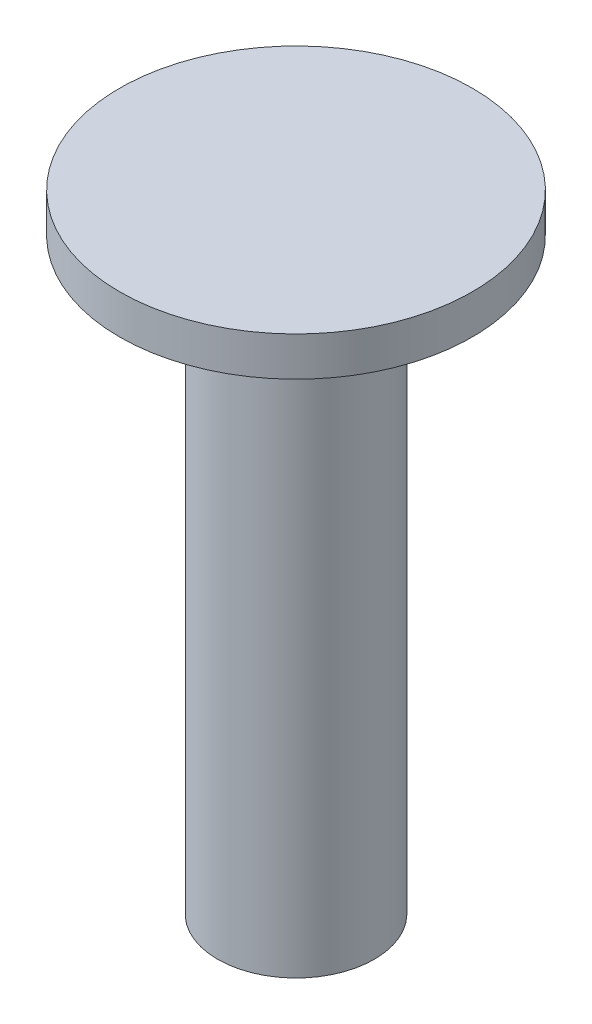
ISO-10303-21;
HEADER;
FILE_DESCRIPTION(('STEP AP214'),'2;1');
FILE_NAME('part.step','',(''),(''),'','','');
FILE_SCHEMA(('AUTOMOTIVE_DESIGN { 1 0 10303 214 1 1 1 1 }'));
ENDSEC;
DATA;
#1=APPLICATION_CONTEXT('core data for automotive mechanical design processes');
#2=APPLICATION_PROTOCOL_DEFINITION('international standard','automotive_design',2000,#1);
#3=PRODUCT_CONTEXT('',#1,'mechanical');
#4=PRODUCT('Part','Part','',(#3));
#5=PRODUCT_RELATED_PRODUCT_CATEGORY('part','',(#4));
#6=PRODUCT_DEFINITION_FORMATION('','',#4);
#7=PRODUCT_DEFINITION_CONTEXT('part definition',#1,'design');
#8=PRODUCT_DEFINITION('design','',#6,#7);
#9=PRODUCT_DEFINITION_SHAPE('','',#8);
#10=(LENGTH_UNIT() NAMED_UNIT(*) SI_UNIT(.MILLI.,.METRE.));
#11=(NAMED_UNIT(*) PLANE_ANGLE_UNIT() SI_UNIT($,.RADIAN.));
#12=(NAMED_UNIT(*) SI_UNIT($,.STERADIAN.) SOLID_ANGLE_UNIT());
#13=UNCERTAINTY_MEASURE_WITH_UNIT(LENGTH_MEASURE(1.E-05),#10,'distance_accuracy_value','');
#14=(GEOMETRIC_REPRESENTATION_CONTEXT(3) GLOBAL_UNCERTAINTY_ASSIGNED_CONTEXT((#13)) GLOBAL_UNIT_ASSIGNED_CONTEXT((#10,
#11,#12)) REPRESENTATION_CONTEXT('',''));
#15=CARTESIAN_POINT('',(0.,0.,0.));
#16=DIRECTION('',(0.,0.,1.));
#17=DIRECTION('',(1.,0.,0.));
#18=AXIS2_PLACEMENT_3D('',#15,#16,#17);
#19=CARTESIAN_POINT('',(0.,30.,0.));
#20=DIRECTION('',(0.,-1.,0.));
#21=DIRECTION('',(0.,0.,-1.));
#22=AXIS2_PLACEMENT_3D('',#19,#20,#21);
#23=CYLINDRICAL_SURFACE('',#22,4.);
#24=CARTESIAN_POINT('',(0.,30.,0.));
#25=DIRECTION('',(0.,1.,0.));
#26=DIRECTION('',(0.,0.,1.));
#27=AXIS2_PLACEMENT_3D('',#24,#25,#26);
#28=CIRCLE('',#27,4.);
#29=CARTESIAN_POINT('',(0.,30.,4.));
#30=VERTEX_POINT('',#29);
#31=EDGE_CURVE('E10',#30,#30,#28,.T.);
#32=ORIENTED_EDGE('',*,*,#31,.F.);
#33=EDGE_LOOP('',(#32));
#34=FACE_BOUND('',#33,.T.);
#35=CARTESIAN_POINT('',(0.,0.,0.));
#36=DIRECTION('',(0.,1.,0.));
#37=DIRECTION('',(0.,0.,1.));
#38=AXIS2_PLACEMENT_3D('',#35,#36,#37);
#39=CIRCLE('',#38,4.);
#40=CARTESIAN_POINT('',(0.,0.,4.));
#41=VERTEX_POINT('',#40);
#42=EDGE_CURVE('E38',#41,#41,#39,.T.);
#43=ORIENTED_EDGE('',*,*,#42,.T.);
#44=EDGE_LOOP('',(#43));
#45=FACE_BOUND('',#44,.T.);
#46=ADVANCED_FACE('F35',(#34,#45),#23,.T.);
#47=CARTESIAN_POINT('',(0.,0.,0.));
#48=DIRECTION('',(0.,1.,0.));
#49=DIRECTION('',(0.,0.,1.));
#50=AXIS2_PLACEMENT_3D('',#47,#48,#49);
#51=PLANE('',#50);
#52=ORIENTED_EDGE('',*,*,#42,.F.);
#53=EDGE_LOOP('',(#52));
#54=FACE_BOUND('',#53,.T.);
#55=ADVANCED_FACE('F58',(#54),#51,.F.);
#56=CARTESIAN_POINT('',(0.,32.,0.));
#57=DIRECTION('',(0.,-1.,0.));
#58=DIRECTION('',(0.,0.,-1.));
#59=AXIS2_PLACEMENT_3D('',#56,#57,#58);
#60=CYLINDRICAL_SURFACE('',#59,9.);
#61=CARTESIAN_POINT('',(0.,32.,0.));
#62=DIRECTION('',(0.,1.,0.));
#63=DIRECTION('',(0.,0.,1.));
#64=AXIS2_PLACEMENT_3D('',#61,#62,#63);
#65=CIRCLE('',#64,9.);
#66=CARTESIAN_POINT('',(0.,32.,9.));
#67=VERTEX_POINT('',#66);
#68=EDGE_CURVE('E45',#67,#67,#65,.T.);
#69=ORIENTED_EDGE('',*,*,#68,.F.);
#70=EDGE_LOOP('',(#69));
#71=FACE_BOUND('',#70,.T.);
#72=CARTESIAN_POINT('',(0.,30.,0.));
#73=DIRECTION('',(0.,1.,0.));
#74=DIRECTION('',(0.,0.,1.));
#75=AXIS2_PLACEMENT_3D('',#72,#73,#74);
#76=CIRCLE('',#75,9.);
#77=CARTESIAN_POINT('',(0.,30.,9.));
#78=VERTEX_POINT('',#77);
#79=EDGE_CURVE('E47',#78,#78,#76,.T.);
#80=ORIENTED_EDGE('',*,*,#79,.T.);
#81=EDGE_LOOP('',(#80));
#82=FACE_BOUND('',#81,.T.);
#83=ADVANCED_FACE('F55',(#71,#82),#60,.T.);
#84=CARTESIAN_POINT('',(0.,32.,0.));
#85=DIRECTION('',(0.,1.,0.));
#86=DIRECTION('',(0.,0.,1.));
#87=AXIS2_PLACEMENT_3D('',#84,#85,#86);
#88=PLANE('',#87);
#89=ORIENTED_EDGE('',*,*,#68,.T.);
#90=EDGE_LOOP('',(#89));
#91=FACE_BOUND('',#90,.T.);
#92=ADVANCED_FACE('F53',(#91),#88,.T.);
#93=CARTESIAN_POINT('',(0.,30.,0.));
#94=DIRECTION('',(0.,1.,0.));
#95=DIRECTION('',(0.,0.,1.));
#96=AXIS2_PLACEMENT_3D('',#93,#94,#95);
#97=PLANE('',#96);
#98=ORIENTED_EDGE('',*,*,#31,.T.);
#99=EDGE_LOOP('',(#98));
#100=FACE_BOUND('',#99,.T.);
#101=ORIENTED_EDGE('',*,*,#79,.F.);
#102=EDGE_LOOP('',(#101));
#103=FACE_BOUND('',#102,.T.);
#104=ADVANCED_FACE('F62',(#100,#103),#97,.F.);
#105=CLOSED_SHELL('',(#46,#55,#83,#92,#104));
#106=MANIFOLD_SOLID_BREP('B2',#105);
#107=ADVANCED_BREP_SHAPE_REPRESENTATION('',(#18,#106),#14);
#108=SHAPE_DEFINITION_REPRESENTATION(#9,#107);
ENDSEC;
END-ISO-10303-21;
